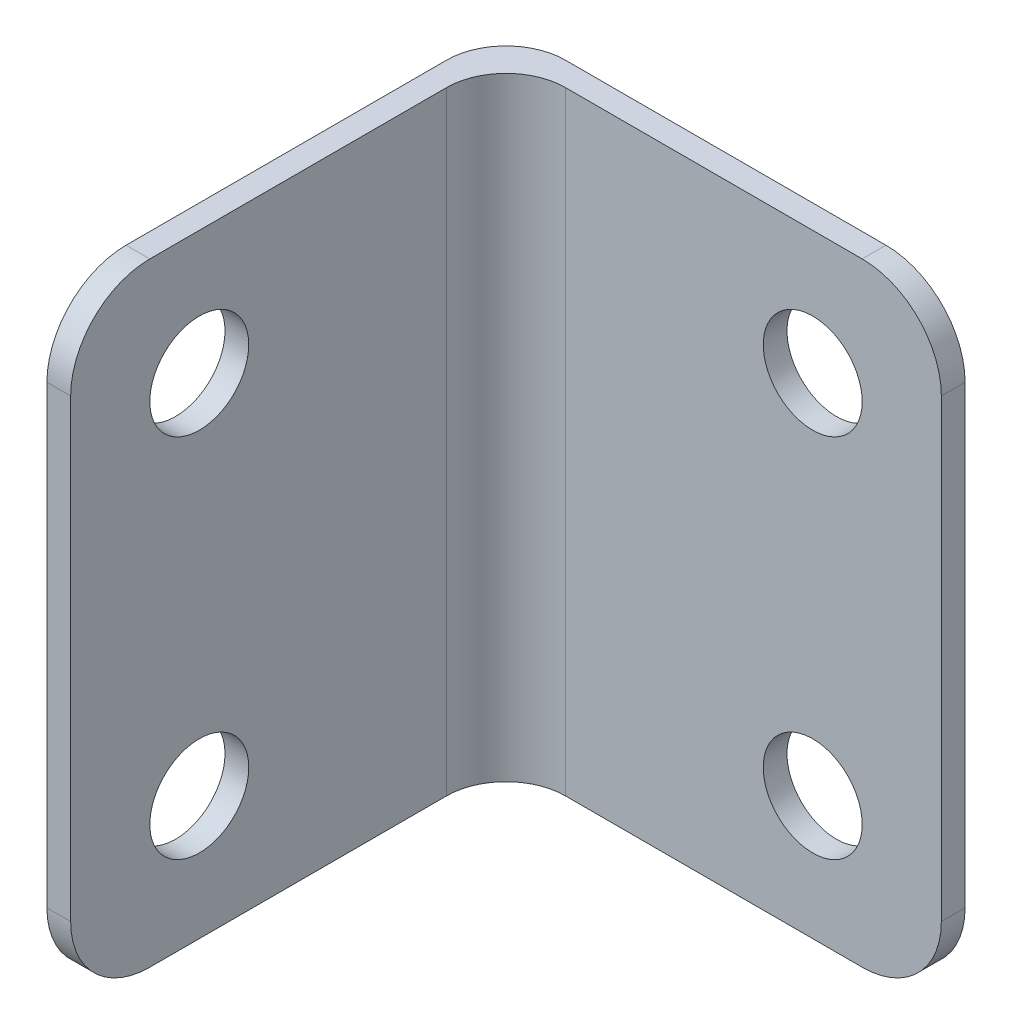
ISO-10303-21;
HEADER;
FILE_DESCRIPTION(('STEP AP214'),'2;1');
FILE_NAME('part.step','',(''),(''),'','','');
FILE_SCHEMA(('AUTOMOTIVE_DESIGN { 1 0 10303 214 1 1 1 1 }'));
ENDSEC;
DATA;
#1=APPLICATION_CONTEXT('core data for automotive mechanical design processes');
#2=APPLICATION_PROTOCOL_DEFINITION('international standard','automotive_design',2000,#1);
#3=PRODUCT_CONTEXT('',#1,'mechanical');
#4=PRODUCT('Part','Part','',(#3));
#5=PRODUCT_RELATED_PRODUCT_CATEGORY('part','',(#4));
#6=PRODUCT_DEFINITION_FORMATION('','',#4);
#7=PRODUCT_DEFINITION_CONTEXT('part definition',#1,'design');
#8=PRODUCT_DEFINITION('design','',#6,#7);
#9=PRODUCT_DEFINITION_SHAPE('','',#8);
#10=(LENGTH_UNIT() NAMED_UNIT(*) SI_UNIT(.MILLI.,.METRE.));
#11=(NAMED_UNIT(*) PLANE_ANGLE_UNIT() SI_UNIT($,.RADIAN.));
#12=(NAMED_UNIT(*) SI_UNIT($,.STERADIAN.) SOLID_ANGLE_UNIT());
#13=UNCERTAINTY_MEASURE_WITH_UNIT(LENGTH_MEASURE(1.E-05),#10,'distance_accuracy_value','');
#14=(GEOMETRIC_REPRESENTATION_CONTEXT(3) GLOBAL_UNCERTAINTY_ASSIGNED_CONTEXT((#13)) GLOBAL_UNIT_ASSIGNED_CONTEXT((#10,
#11,#12)) REPRESENTATION_CONTEXT('',''));
#15=CARTESIAN_POINT('',(0.,0.,0.));
#16=DIRECTION('',(0.,0.,1.));
#17=DIRECTION('',(1.,0.,0.));
#18=AXIS2_PLACEMENT_3D('',#15,#16,#17);
#19=CARTESIAN_POINT('',(0.,31.,3.00000000000002));
#20=DIRECTION('',(1.,0.,0.));
#21=DIRECTION('',(0.,0.,-1.));
#22=AXIS2_PLACEMENT_3D('',#19,#20,#21);
#23=PLANE('',#22);
#24=CARTESIAN_POINT('',(0.,24.75,16.7));
#25=DIRECTION('',(1.,0.,0.));
#26=DIRECTION('',(0.,0.,-1.));
#27=AXIS2_PLACEMENT_3D('',#24,#25,#26);
#28=CIRCLE('',#27,2.5);
#29=CARTESIAN_POINT('',(0.,24.75,14.2));
#30=VERTEX_POINT('',#29);
#31=EDGE_CURVE('E295',#30,#30,#28,.F.);
#32=ORIENTED_EDGE('',*,*,#31,.F.);
#33=EDGE_LOOP('',(#32));
#34=FACE_BOUND('',#33,.T.);
#35=CARTESIAN_POINT('',(0.,6.25,16.7));
#36=DIRECTION('',(1.,0.,0.));
#37=DIRECTION('',(0.,0.,-1.));
#38=AXIS2_PLACEMENT_3D('',#35,#36,#37);
#39=CIRCLE('',#38,2.5);
#40=CARTESIAN_POINT('',(0.,6.25,14.2));
#41=VERTEX_POINT('',#40);
#42=EDGE_CURVE('E298',#41,#41,#39,.T.);
#43=ORIENTED_EDGE('',*,*,#42,.T.);
#44=EDGE_LOOP('',(#43));
#45=FACE_BOUND('',#44,.T.);
#46=DIRECTION('',(0.,0.,1.));
#47=VECTOR('',#46,1.);
#48=CARTESIAN_POINT('',(0.,0.,3.00000000000002));
#49=LINE('',#48,#47);
#50=CARTESIAN_POINT('',(0.,0.,3.00000000000002));
#51=VERTEX_POINT('',#50);
#52=CARTESIAN_POINT('',(0.,0.,19.2));
#53=VERTEX_POINT('',#52);
#54=EDGE_CURVE('E190',#51,#53,#49,.T.);
#55=ORIENTED_EDGE('',*,*,#54,.T.);
#56=CARTESIAN_POINT('',(0.,4.,19.2));
#57=DIRECTION('',(1.,0.,0.));
#58=DIRECTION('',(0.,0.,-1.));
#59=AXIS2_PLACEMENT_3D('',#56,#57,#58);
#60=CIRCLE('',#59,4.);
#61=CARTESIAN_POINT('',(0.,4.,23.2));
#62=VERTEX_POINT('',#61);
#63=EDGE_CURVE('E106',#53,#62,#60,.F.);
#64=ORIENTED_EDGE('',*,*,#63,.T.);
#65=DIRECTION('',(0.,-1.,0.));
#66=VECTOR('',#65,1.);
#67=CARTESIAN_POINT('',(0.,31.,23.2));
#68=LINE('',#67,#66);
#69=CARTESIAN_POINT('',(0.,27.,23.2));
#70=VERTEX_POINT('',#69);
#71=EDGE_CURVE('E211',#70,#62,#68,.T.);
#72=ORIENTED_EDGE('',*,*,#71,.F.);
#73=CARTESIAN_POINT('',(0.,27.,19.2));
#74=DIRECTION('',(1.,0.,0.));
#75=DIRECTION('',(0.,0.,-1.));
#76=AXIS2_PLACEMENT_3D('',#73,#74,#75);
#77=CIRCLE('',#76,4.);
#78=CARTESIAN_POINT('',(0.,31.,19.2));
#79=VERTEX_POINT('',#78);
#80=EDGE_CURVE('E268',#79,#70,#77,.T.);
#81=ORIENTED_EDGE('',*,*,#80,.F.);
#82=DIRECTION('',(0.,0.,1.));
#83=VECTOR('',#82,1.);
#84=CARTESIAN_POINT('',(0.,31.,3.00000000000002));
#85=LINE('',#84,#83);
#86=CARTESIAN_POINT('',(0.,31.,3.00000000000002));
#87=VERTEX_POINT('',#86);
#88=EDGE_CURVE('E266',#87,#79,#85,.T.);
#89=ORIENTED_EDGE('',*,*,#88,.F.);
#90=DIRECTION('',(0.,-1.,0.));
#91=VECTOR('',#90,1.);
#92=CARTESIAN_POINT('',(0.,31.,3.00000000000002));
#93=LINE('',#92,#91);
#94=EDGE_CURVE('E214',#87,#51,#93,.T.);
#95=ORIENTED_EDGE('',*,*,#94,.T.);
#96=EDGE_LOOP('',(#55,#64,#72,#81,#89,#95));
#97=FACE_BOUND('',#96,.T.);
#98=ADVANCED_FACE('F83',(#34,#45,#97),#23,.F.);
#99=CARTESIAN_POINT('',(1.2,31.,23.2));
#100=DIRECTION('',(0.,0.,-1.));
#101=DIRECTION('',(-1.,0.,0.));
#102=AXIS2_PLACEMENT_3D('',#99,#100,#101);
#103=PLANE('',#102);
#104=DIRECTION('',(1.,0.,0.));
#105=VECTOR('',#104,1.);
#106=CARTESIAN_POINT('',(-29.3,4.,23.2));
#107=LINE('',#106,#105);
#108=CARTESIAN_POINT('',(1.2,4.,23.2));
#109=VERTEX_POINT('',#108);
#110=EDGE_CURVE('E184',#62,#109,#107,.T.);
#111=ORIENTED_EDGE('',*,*,#110,.T.);
#112=DIRECTION('',(0.,-1.,0.));
#113=VECTOR('',#112,1.);
#114=CARTESIAN_POINT('',(1.2,31.,23.2));
#115=LINE('',#114,#113);
#116=CARTESIAN_POINT('',(1.2,27.,23.2));
#117=VERTEX_POINT('',#116);
#118=EDGE_CURVE('E183',#117,#109,#115,.T.);
#119=ORIENTED_EDGE('',*,*,#118,.F.);
#120=DIRECTION('',(1.,0.,0.));
#121=VECTOR('',#120,1.);
#122=CARTESIAN_POINT('',(-29.3,27.,23.2));
#123=LINE('',#122,#121);
#124=EDGE_CURVE('E98',#70,#117,#123,.T.);
#125=ORIENTED_EDGE('',*,*,#124,.F.);
#126=ORIENTED_EDGE('',*,*,#71,.T.);
#127=EDGE_LOOP('',(#111,#119,#125,#126));
#128=FACE_BOUND('',#127,.T.);
#129=ADVANCED_FACE('F327',(#128),#103,.F.);
#130=CARTESIAN_POINT('',(1.2,31.,4.20000000000002));
#131=DIRECTION('',(-1.,0.,0.));
#132=DIRECTION('',(0.,0.,1.));
#133=AXIS2_PLACEMENT_3D('',#130,#131,#132);
#134=PLANE('',#133);
#135=CARTESIAN_POINT('',(1.2,24.75,16.7));
#136=DIRECTION('',(1.,0.,0.));
#137=DIRECTION('',(0.,0.,-1.));
#138=AXIS2_PLACEMENT_3D('',#135,#136,#137);
#139=CIRCLE('',#138,2.5);
#140=CARTESIAN_POINT('',(1.2,24.75,14.2));
#141=VERTEX_POINT('',#140);
#142=EDGE_CURVE('E310',#141,#141,#139,.F.);
#143=ORIENTED_EDGE('',*,*,#142,.T.);
#144=EDGE_LOOP('',(#143));
#145=FACE_BOUND('',#144,.T.);
#146=CARTESIAN_POINT('',(1.2,6.25,16.7));
#147=DIRECTION('',(1.,0.,0.));
#148=DIRECTION('',(0.,0.,-1.));
#149=AXIS2_PLACEMENT_3D('',#146,#147,#148);
#150=CIRCLE('',#149,2.5);
#151=CARTESIAN_POINT('',(1.2,6.25,14.2));
#152=VERTEX_POINT('',#151);
#153=EDGE_CURVE('E302',#152,#152,#150,.T.);
#154=ORIENTED_EDGE('',*,*,#153,.F.);
#155=EDGE_LOOP('',(#154));
#156=FACE_BOUND('',#155,.T.);
#157=ORIENTED_EDGE('',*,*,#118,.T.);
#158=CARTESIAN_POINT('',(1.2,4.,19.2));
#159=DIRECTION('',(1.,0.,0.));
#160=DIRECTION('',(0.,0.,-1.));
#161=AXIS2_PLACEMENT_3D('',#158,#159,#160);
#162=CIRCLE('',#161,4.);
#163=CARTESIAN_POINT('',(1.2,0.,19.2));
#164=VERTEX_POINT('',#163);
#165=EDGE_CURVE('E170',#164,#109,#162,.F.);
#166=ORIENTED_EDGE('',*,*,#165,.F.);
#167=DIRECTION('',(0.,0.,-1.));
#168=VECTOR('',#167,1.);
#169=CARTESIAN_POINT('',(1.2,0.,4.20000000000002));
#170=LINE('',#169,#168);
#171=CARTESIAN_POINT('',(1.2,0.,4.20000000000002));
#172=VERTEX_POINT('',#171);
#173=EDGE_CURVE('E180',#164,#172,#170,.T.);
#174=ORIENTED_EDGE('',*,*,#173,.T.);
#175=DIRECTION('',(0.,-1.,0.));
#176=VECTOR('',#175,1.);
#177=CARTESIAN_POINT('',(1.2,31.,4.20000000000002));
#178=LINE('',#177,#176);
#179=CARTESIAN_POINT('',(1.2,31.,4.20000000000002));
#180=VERTEX_POINT('',#179);
#181=EDGE_CURVE('E208',#180,#172,#178,.T.);
#182=ORIENTED_EDGE('',*,*,#181,.F.);
#183=DIRECTION('',(0.,0.,-1.));
#184=VECTOR('',#183,1.);
#185=CARTESIAN_POINT('',(1.2,31.,4.20000000000002));
#186=LINE('',#185,#184);
#187=CARTESIAN_POINT('',(1.2,31.,19.2));
#188=VERTEX_POINT('',#187);
#189=EDGE_CURVE('E250',#188,#180,#186,.T.);
#190=ORIENTED_EDGE('',*,*,#189,.F.);
#191=CARTESIAN_POINT('',(1.2,27.,19.2));
#192=DIRECTION('',(1.,0.,0.));
#193=DIRECTION('',(0.,0.,-1.));
#194=AXIS2_PLACEMENT_3D('',#191,#192,#193);
#195=CIRCLE('',#194,4.);
#196=EDGE_CURVE('E307',#188,#117,#195,.T.);
#197=ORIENTED_EDGE('',*,*,#196,.T.);
#198=EDGE_LOOP('',(#157,#166,#174,#182,#190,#197));
#199=FACE_BOUND('',#198,.T.);
#200=ADVANCED_FACE('F178',(#145,#156,#199),#134,.F.);
#201=CARTESIAN_POINT('',(4.2,0.,4.2));
#202=DIRECTION('',(0.,-1.,0.));
#203=DIRECTION('',(0.,0.,-1.));
#204=AXIS2_PLACEMENT_3D('',#201,#202,#203);
#205=PLANE('',#204);
#206=ORIENTED_EDGE('',*,*,#173,.F.);
#207=DIRECTION('',(1.,0.,0.));
#208=VECTOR('',#207,1.);
#209=CARTESIAN_POINT('',(-29.3,0.,19.2));
#210=LINE('',#209,#208);
#211=EDGE_CURVE('E12',#164,#53,#210,.F.);
#212=ORIENTED_EDGE('',*,*,#211,.T.);
#213=ORIENTED_EDGE('',*,*,#54,.F.);
#214=CARTESIAN_POINT('',(3.,0.,3.));
#215=DIRECTION('',(0.,1.,0.));
#216=DIRECTION('',(0.,0.,-1.));
#217=AXIS2_PLACEMENT_3D('',#214,#215,#216);
#218=CIRCLE('',#217,3.);
#219=CARTESIAN_POINT('',(3.00000000000002,0.,0.));
#220=VERTEX_POINT('',#219);
#221=EDGE_CURVE('E194',#220,#51,#218,.T.);
#222=ORIENTED_EDGE('',*,*,#221,.F.);
#223=DIRECTION('',(-1.,0.,0.));
#224=VECTOR('',#223,1.);
#225=CARTESIAN_POINT('',(3.00000000000002,0.,0.));
#226=LINE('',#225,#224);
#227=CARTESIAN_POINT('',(19.2,0.,0.));
#228=VERTEX_POINT('',#227);
#229=EDGE_CURVE('E254',#228,#220,#226,.T.);
#230=ORIENTED_EDGE('',*,*,#229,.F.);
#231=DIRECTION('',(0.,0.,1.));
#232=VECTOR('',#231,1.);
#233=CARTESIAN_POINT('',(19.2,0.,-29.3));
#234=LINE('',#233,#232);
#235=CARTESIAN_POINT('',(19.2,0.,1.2));
#236=VERTEX_POINT('',#235);
#237=EDGE_CURVE('E223',#236,#228,#234,.F.);
#238=ORIENTED_EDGE('',*,*,#237,.F.);
#239=DIRECTION('',(1.,0.,0.));
#240=VECTOR('',#239,1.);
#241=CARTESIAN_POINT('',(23.2,0.,1.2));
#242=LINE('',#241,#240);
#243=CARTESIAN_POINT('',(4.2,0.,1.2));
#244=VERTEX_POINT('',#243);
#245=EDGE_CURVE('E192',#244,#236,#242,.T.);
#246=ORIENTED_EDGE('',*,*,#245,.F.);
#247=CARTESIAN_POINT('',(4.2,0.,4.2));
#248=DIRECTION('',(0.,-1.,0.));
#249=DIRECTION('',(0.,0.,-1.));
#250=AXIS2_PLACEMENT_3D('',#247,#248,#249);
#251=CIRCLE('',#250,3.);
#252=EDGE_CURVE('E189',#172,#244,#251,.T.);
#253=ORIENTED_EDGE('',*,*,#252,.F.);
#254=EDGE_LOOP('',(#206,#212,#213,#222,#230,#238,#246,#253));
#255=FACE_BOUND('',#254,.T.);
#256=ADVANCED_FACE('F187',(#255),#205,.T.);
#257=CARTESIAN_POINT('',(3.00000000000002,31.,0.));
#258=DIRECTION('',(0.,0.,1.));
#259=DIRECTION('',(1.,0.,0.));
#260=AXIS2_PLACEMENT_3D('',#257,#258,#259);
#261=PLANE('',#260);
#262=CARTESIAN_POINT('',(16.7,24.75,0.));
#263=DIRECTION('',(0.,0.,1.));
#264=DIRECTION('',(1.,0.,0.));
#265=AXIS2_PLACEMENT_3D('',#262,#263,#264);
#266=CIRCLE('',#265,2.5);
#267=CARTESIAN_POINT('',(19.2,24.75,0.));
#268=VERTEX_POINT('',#267);
#269=EDGE_CURVE('E255',#268,#268,#266,.T.);
#270=ORIENTED_EDGE('',*,*,#269,.T.);
#271=EDGE_LOOP('',(#270));
#272=FACE_BOUND('',#271,.T.);
#273=DIRECTION('',(0.,-1.,0.));
#274=VECTOR('',#273,1.);
#275=CARTESIAN_POINT('',(23.2,31.,0.));
#276=LINE('',#275,#274);
#277=CARTESIAN_POINT('',(23.2,27.,0.));
#278=VERTEX_POINT('',#277);
#279=CARTESIAN_POINT('',(23.2,4.,0.));
#280=VERTEX_POINT('',#279);
#281=EDGE_CURVE('E220',#278,#280,#276,.T.);
#282=ORIENTED_EDGE('',*,*,#281,.T.);
#283=CARTESIAN_POINT('',(19.2,4.,0.));
#284=DIRECTION('',(0.,0.,1.));
#285=DIRECTION('',(1.,0.,0.));
#286=AXIS2_PLACEMENT_3D('',#283,#284,#285);
#287=CIRCLE('',#286,4.);
#288=EDGE_CURVE('E281',#280,#228,#287,.F.);
#289=ORIENTED_EDGE('',*,*,#288,.T.);
#290=ORIENTED_EDGE('',*,*,#229,.T.);
#291=DIRECTION('',(0.,-1.,0.));
#292=VECTOR('',#291,1.);
#293=CARTESIAN_POINT('',(3.00000000000002,31.,0.));
#294=LINE('',#293,#292);
#295=CARTESIAN_POINT('',(3.00000000000002,31.,0.));
#296=VERTEX_POINT('',#295);
#297=EDGE_CURVE('E217',#296,#220,#294,.T.);
#298=ORIENTED_EDGE('',*,*,#297,.F.);
#299=DIRECTION('',(-1.,0.,0.));
#300=VECTOR('',#299,1.);
#301=CARTESIAN_POINT('',(3.00000000000002,31.,0.));
#302=LINE('',#301,#300);
#303=CARTESIAN_POINT('',(19.2,31.,0.));
#304=VERTEX_POINT('',#303);
#305=EDGE_CURVE('E200',#304,#296,#302,.T.);
#306=ORIENTED_EDGE('',*,*,#305,.F.);
#307=CARTESIAN_POINT('',(19.2,27.,0.));
#308=DIRECTION('',(0.,0.,1.));
#309=DIRECTION('',(1.,0.,0.));
#310=AXIS2_PLACEMENT_3D('',#307,#308,#309);
#311=CIRCLE('',#310,4.);
#312=EDGE_CURVE('E231',#278,#304,#311,.T.);
#313=ORIENTED_EDGE('',*,*,#312,.F.);
#314=EDGE_LOOP('',(#282,#289,#290,#298,#306,#313));
#315=FACE_BOUND('',#314,.T.);
#316=CARTESIAN_POINT('',(16.7,6.25,0.));
#317=DIRECTION('',(0.,0.,1.));
#318=DIRECTION('',(1.,0.,0.));
#319=AXIS2_PLACEMENT_3D('',#316,#317,#318);
#320=CIRCLE('',#319,2.5);
#321=CARTESIAN_POINT('',(19.2,6.25,0.));
#322=VERTEX_POINT('',#321);
#323=EDGE_CURVE('E277',#322,#322,#320,.F.);
#324=ORIENTED_EDGE('',*,*,#323,.F.);
#325=EDGE_LOOP('',(#324));
#326=FACE_BOUND('',#325,.T.);
#327=ADVANCED_FACE('F359',(#272,#315,#326),#261,.F.);
#328=CARTESIAN_POINT('',(23.2,31.,1.2));
#329=DIRECTION('',(0.,0.,-1.));
#330=DIRECTION('',(-1.,0.,0.));
#331=AXIS2_PLACEMENT_3D('',#328,#329,#330);
#332=PLANE('',#331);
#333=CARTESIAN_POINT('',(16.7,24.75,1.2));
#334=DIRECTION('',(0.,0.,1.));
#335=DIRECTION('',(1.,0.,0.));
#336=AXIS2_PLACEMENT_3D('',#333,#334,#335);
#337=CIRCLE('',#336,2.5);
#338=CARTESIAN_POINT('',(19.2,24.75,1.2));
#339=VERTEX_POINT('',#338);
#340=EDGE_CURVE('E242',#339,#339,#337,.T.);
#341=ORIENTED_EDGE('',*,*,#340,.F.);
#342=EDGE_LOOP('',(#341));
#343=FACE_BOUND('',#342,.T.);
#344=ORIENTED_EDGE('',*,*,#245,.T.);
#345=CARTESIAN_POINT('',(19.2,4.,1.2));
#346=DIRECTION('',(0.,0.,1.));
#347=DIRECTION('',(1.,0.,0.));
#348=AXIS2_PLACEMENT_3D('',#345,#346,#347);
#349=CIRCLE('',#348,4.);
#350=CARTESIAN_POINT('',(23.2,4.,1.2));
#351=VERTEX_POINT('',#350);
#352=EDGE_CURVE('E287',#351,#236,#349,.F.);
#353=ORIENTED_EDGE('',*,*,#352,.F.);
#354=DIRECTION('',(0.,-1.,0.));
#355=VECTOR('',#354,1.);
#356=CARTESIAN_POINT('',(23.2,31.,1.2));
#357=LINE('',#356,#355);
#358=CARTESIAN_POINT('',(23.2,27.,1.2));
#359=VERTEX_POINT('',#358);
#360=EDGE_CURVE('E201',#359,#351,#357,.T.);
#361=ORIENTED_EDGE('',*,*,#360,.F.);
#362=CARTESIAN_POINT('',(19.2,27.,1.2));
#363=DIRECTION('',(0.,0.,1.));
#364=DIRECTION('',(1.,0.,0.));
#365=AXIS2_PLACEMENT_3D('',#362,#363,#364);
#366=CIRCLE('',#365,4.);
#367=CARTESIAN_POINT('',(19.2,31.,1.2));
#368=VERTEX_POINT('',#367);
#369=EDGE_CURVE('E228',#359,#368,#366,.T.);
#370=ORIENTED_EDGE('',*,*,#369,.T.);
#371=DIRECTION('',(1.,0.,0.));
#372=VECTOR('',#371,1.);
#373=CARTESIAN_POINT('',(23.2,31.,1.2));
#374=LINE('',#373,#372);
#375=CARTESIAN_POINT('',(4.2,31.,1.2));
#376=VERTEX_POINT('',#375);
#377=EDGE_CURVE('E205',#376,#368,#374,.T.);
#378=ORIENTED_EDGE('',*,*,#377,.F.);
#379=DIRECTION('',(0.,-1.,0.));
#380=VECTOR('',#379,1.);
#381=CARTESIAN_POINT('',(4.2,31.,1.2));
#382=LINE('',#381,#380);
#383=EDGE_CURVE('E204',#376,#244,#382,.T.);
#384=ORIENTED_EDGE('',*,*,#383,.T.);
#385=EDGE_LOOP('',(#344,#353,#361,#370,#378,#384));
#386=FACE_BOUND('',#385,.T.);
#387=CARTESIAN_POINT('',(16.7,6.25,1.2));
#388=DIRECTION('',(0.,0.,1.));
#389=DIRECTION('',(1.,0.,0.));
#390=AXIS2_PLACEMENT_3D('',#387,#388,#389);
#391=CIRCLE('',#390,2.5);
#392=CARTESIAN_POINT('',(19.2,6.25,1.2));
#393=VERTEX_POINT('',#392);
#394=EDGE_CURVE('E289',#393,#393,#391,.F.);
#395=ORIENTED_EDGE('',*,*,#394,.T.);
#396=EDGE_LOOP('',(#395));
#397=FACE_BOUND('',#396,.T.);
#398=ADVANCED_FACE('F238',(#343,#386,#397),#332,.F.);
#399=CARTESIAN_POINT('',(4.2,31.,4.2));
#400=DIRECTION('',(0.,-1.,0.));
#401=DIRECTION('',(0.,0.,-1.));
#402=AXIS2_PLACEMENT_3D('',#399,#400,#401);
#403=PLANE('',#402);
#404=ORIENTED_EDGE('',*,*,#88,.T.);
#405=DIRECTION('',(1.,0.,0.));
#406=VECTOR('',#405,1.);
#407=CARTESIAN_POINT('',(-29.3,31.,19.2));
#408=LINE('',#407,#406);
#409=EDGE_CURVE('E305',#79,#188,#408,.T.);
#410=ORIENTED_EDGE('',*,*,#409,.T.);
#411=ORIENTED_EDGE('',*,*,#189,.T.);
#412=CARTESIAN_POINT('',(4.2,31.,4.2));
#413=DIRECTION('',(0.,-1.,0.));
#414=DIRECTION('',(0.,0.,-1.));
#415=AXIS2_PLACEMENT_3D('',#412,#413,#414);
#416=CIRCLE('',#415,3.);
#417=EDGE_CURVE('E247',#180,#376,#416,.T.);
#418=ORIENTED_EDGE('',*,*,#417,.T.);
#419=ORIENTED_EDGE('',*,*,#377,.T.);
#420=DIRECTION('',(0.,0.,1.));
#421=VECTOR('',#420,1.);
#422=CARTESIAN_POINT('',(19.2,31.,-29.3));
#423=LINE('',#422,#421);
#424=EDGE_CURVE('E91',#304,#368,#423,.T.);
#425=ORIENTED_EDGE('',*,*,#424,.F.);
#426=ORIENTED_EDGE('',*,*,#305,.T.);
#427=CARTESIAN_POINT('',(3.,31.,3.));
#428=DIRECTION('',(0.,1.,0.));
#429=DIRECTION('',(0.,0.,-1.));
#430=AXIS2_PLACEMENT_3D('',#427,#428,#429);
#431=CIRCLE('',#430,3.);
#432=EDGE_CURVE('E270',#296,#87,#431,.T.);
#433=ORIENTED_EDGE('',*,*,#432,.T.);
#434=EDGE_LOOP('',(#404,#410,#411,#418,#419,#425,#426,#433));
#435=FACE_BOUND('',#434,.T.);
#436=ADVANCED_FACE('F245',(#435),#403,.F.);
#437=CARTESIAN_POINT('',(23.2,31.,0.));
#438=DIRECTION('',(-1.,0.,0.));
#439=DIRECTION('',(0.,0.,1.));
#440=AXIS2_PLACEMENT_3D('',#437,#438,#439);
#441=PLANE('',#440);
#442=ORIENTED_EDGE('',*,*,#360,.T.);
#443=DIRECTION('',(0.,0.,1.));
#444=VECTOR('',#443,1.);
#445=CARTESIAN_POINT('',(23.2,4.,-29.3));
#446=LINE('',#445,#444);
#447=EDGE_CURVE('E285',#280,#351,#446,.T.);
#448=ORIENTED_EDGE('',*,*,#447,.F.);
#449=ORIENTED_EDGE('',*,*,#281,.F.);
#450=DIRECTION('',(0.,0.,1.));
#451=VECTOR('',#450,1.);
#452=CARTESIAN_POINT('',(23.2,27.,-29.3));
#453=LINE('',#452,#451);
#454=EDGE_CURVE('E241',#278,#359,#453,.T.);
#455=ORIENTED_EDGE('',*,*,#454,.T.);
#456=EDGE_LOOP('',(#442,#448,#449,#455));
#457=FACE_BOUND('',#456,.T.);
#458=ADVANCED_FACE('F85',(#457),#441,.F.);
#459=CARTESIAN_POINT('',(3.,31.,3.));
#460=DIRECTION('',(0.,-1.,0.));
#461=DIRECTION('',(0.,0.,-1.));
#462=AXIS2_PLACEMENT_3D('',#459,#460,#461);
#463=CYLINDRICAL_SURFACE('',#462,3.);
#464=ORIENTED_EDGE('',*,*,#221,.T.);
#465=ORIENTED_EDGE('',*,*,#94,.F.);
#466=ORIENTED_EDGE('',*,*,#432,.F.);
#467=ORIENTED_EDGE('',*,*,#297,.T.);
#468=EDGE_LOOP('',(#464,#465,#466,#467));
#469=FACE_BOUND('',#468,.T.);
#470=ADVANCED_FACE('F259',(#469),#463,.T.);
#471=CARTESIAN_POINT('',(4.2,31.,4.2));
#472=DIRECTION('',(0.,-1.,0.));
#473=DIRECTION('',(0.,0.,-1.));
#474=AXIS2_PLACEMENT_3D('',#471,#472,#473);
#475=CYLINDRICAL_SURFACE('',#474,3.);
#476=ORIENTED_EDGE('',*,*,#252,.T.);
#477=ORIENTED_EDGE('',*,*,#383,.F.);
#478=ORIENTED_EDGE('',*,*,#417,.F.);
#479=ORIENTED_EDGE('',*,*,#181,.T.);
#480=EDGE_LOOP('',(#476,#477,#478,#479));
#481=FACE_BOUND('',#480,.T.);
#482=ADVANCED_FACE('F351',(#481),#475,.F.);
#483=CARTESIAN_POINT('',(19.2,4.,-29.3));
#484=DIRECTION('',(0.,0.,1.));
#485=DIRECTION('',(1.,0.,0.));
#486=AXIS2_PLACEMENT_3D('',#483,#484,#485);
#487=CYLINDRICAL_SURFACE('',#486,4.);
#488=ORIENTED_EDGE('',*,*,#447,.T.);
#489=ORIENTED_EDGE('',*,*,#352,.T.);
#490=ORIENTED_EDGE('',*,*,#237,.T.);
#491=ORIENTED_EDGE('',*,*,#288,.F.);
#492=EDGE_LOOP('',(#488,#489,#490,#491));
#493=FACE_BOUND('',#492,.T.);
#494=ADVANCED_FACE('F348',(#493),#487,.T.);
#495=CARTESIAN_POINT('',(19.2,27.,-29.3));
#496=DIRECTION('',(0.,0.,1.));
#497=DIRECTION('',(1.,0.,0.));
#498=AXIS2_PLACEMENT_3D('',#495,#496,#497);
#499=CYLINDRICAL_SURFACE('',#498,4.);
#500=ORIENTED_EDGE('',*,*,#312,.T.);
#501=ORIENTED_EDGE('',*,*,#424,.T.);
#502=ORIENTED_EDGE('',*,*,#369,.F.);
#503=ORIENTED_EDGE('',*,*,#454,.F.);
#504=EDGE_LOOP('',(#500,#501,#502,#503));
#505=FACE_BOUND('',#504,.T.);
#506=ADVANCED_FACE('F227',(#505),#499,.T.);
#507=CARTESIAN_POINT('',(16.7,6.25,-29.3));
#508=DIRECTION('',(0.,0.,1.));
#509=DIRECTION('',(1.,0.,0.));
#510=AXIS2_PLACEMENT_3D('',#507,#508,#509);
#511=CYLINDRICAL_SURFACE('',#510,2.5);
#512=ORIENTED_EDGE('',*,*,#394,.F.);
#513=EDGE_LOOP('',(#512));
#514=FACE_BOUND('',#513,.T.);
#515=ORIENTED_EDGE('',*,*,#323,.T.);
#516=EDGE_LOOP('',(#515));
#517=FACE_BOUND('',#516,.T.);
#518=ADVANCED_FACE('F341',(#514,#517),#511,.F.);
#519=CARTESIAN_POINT('',(16.7,24.75,-29.3));
#520=DIRECTION('',(0.,0.,1.));
#521=DIRECTION('',(1.,0.,0.));
#522=AXIS2_PLACEMENT_3D('',#519,#520,#521);
#523=CYLINDRICAL_SURFACE('',#522,2.5);
#524=ORIENTED_EDGE('',*,*,#340,.T.);
#525=EDGE_LOOP('',(#524));
#526=FACE_BOUND('',#525,.T.);
#527=ORIENTED_EDGE('',*,*,#269,.F.);
#528=EDGE_LOOP('',(#527));
#529=FACE_BOUND('',#528,.T.);
#530=ADVANCED_FACE('F337',(#526,#529),#523,.F.);
#531=CARTESIAN_POINT('',(-29.3,4.,19.2));
#532=DIRECTION('',(1.,0.,0.));
#533=DIRECTION('',(0.,0.,-1.));
#534=AXIS2_PLACEMENT_3D('',#531,#532,#533);
#535=CYLINDRICAL_SURFACE('',#534,4.);
#536=ORIENTED_EDGE('',*,*,#211,.F.);
#537=ORIENTED_EDGE('',*,*,#165,.T.);
#538=ORIENTED_EDGE('',*,*,#110,.F.);
#539=ORIENTED_EDGE('',*,*,#63,.F.);
#540=EDGE_LOOP('',(#536,#537,#538,#539));
#541=FACE_BOUND('',#540,.T.);
#542=ADVANCED_FACE('F169',(#541),#535,.T.);
#543=CARTESIAN_POINT('',(-29.3,6.25,16.7));
#544=DIRECTION('',(1.,0.,0.));
#545=DIRECTION('',(0.,0.,-1.));
#546=AXIS2_PLACEMENT_3D('',#543,#544,#545);
#547=CYLINDRICAL_SURFACE('',#546,2.5);
#548=ORIENTED_EDGE('',*,*,#153,.T.);
#549=EDGE_LOOP('',(#548));
#550=FACE_BOUND('',#549,.T.);
#551=ORIENTED_EDGE('',*,*,#42,.F.);
#552=EDGE_LOOP('',(#551));
#553=FACE_BOUND('',#552,.T.);
#554=ADVANCED_FACE('F321',(#550,#553),#547,.F.);
#555=CARTESIAN_POINT('',(-29.3,24.75,16.7));
#556=DIRECTION('',(1.,0.,0.));
#557=DIRECTION('',(0.,0.,-1.));
#558=AXIS2_PLACEMENT_3D('',#555,#556,#557);
#559=CYLINDRICAL_SURFACE('',#558,2.5);
#560=ORIENTED_EDGE('',*,*,#142,.F.);
#561=EDGE_LOOP('',(#560));
#562=FACE_BOUND('',#561,.T.);
#563=ORIENTED_EDGE('',*,*,#31,.T.);
#564=EDGE_LOOP('',(#563));
#565=FACE_BOUND('',#564,.T.);
#566=ADVANCED_FACE('F317',(#562,#565),#559,.F.);
#567=CARTESIAN_POINT('',(-29.3,27.,19.2));
#568=DIRECTION('',(1.,0.,0.));
#569=DIRECTION('',(0.,0.,-1.));
#570=AXIS2_PLACEMENT_3D('',#567,#568,#569);
#571=CYLINDRICAL_SURFACE('',#570,4.);
#572=ORIENTED_EDGE('',*,*,#80,.T.);
#573=ORIENTED_EDGE('',*,*,#124,.T.);
#574=ORIENTED_EDGE('',*,*,#196,.F.);
#575=ORIENTED_EDGE('',*,*,#409,.F.);
#576=EDGE_LOOP('',(#572,#573,#574,#575));
#577=FACE_BOUND('',#576,.T.);
#578=ADVANCED_FACE('F320',(#577),#571,.T.);
#579=CLOSED_SHELL('',(#98,#129,#200,#256,#327,#398,#436,#458,#470,#482,#494,#506,#518,#530,#542,
#554,#566,#578));
#580=MANIFOLD_SOLID_BREP('B2',#579);
#581=ADVANCED_BREP_SHAPE_REPRESENTATION('',(#18,#580),#14);
#582=SHAPE_DEFINITION_REPRESENTATION(#9,#581);
ENDSEC;
END-ISO-10303-21;
